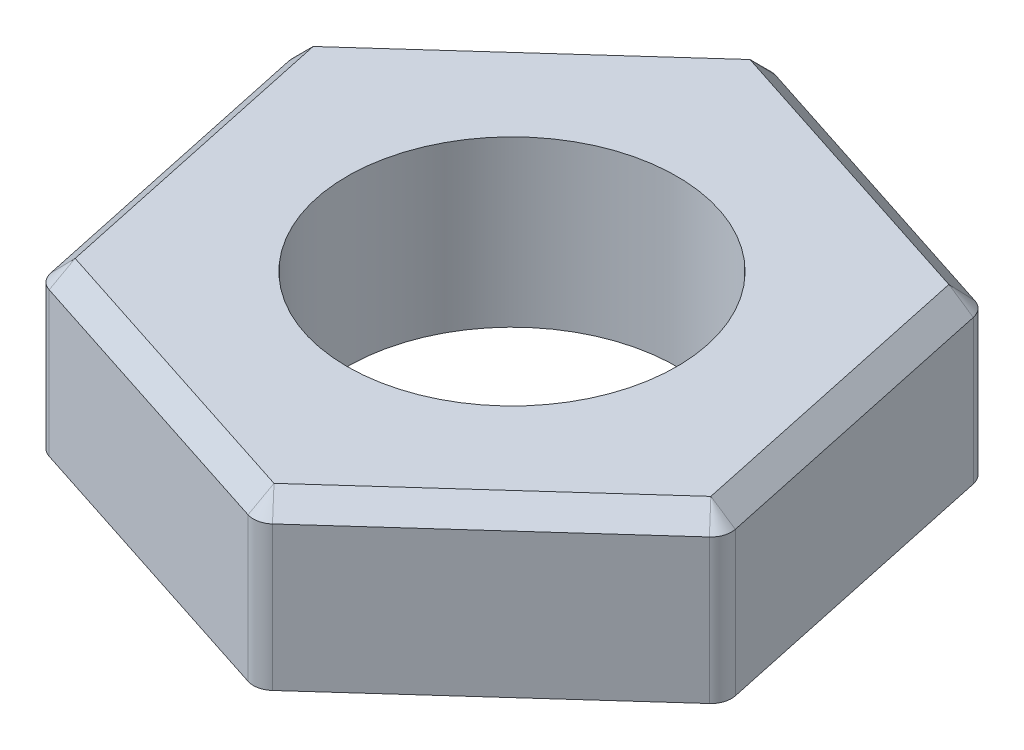
ISO-10303-21;
HEADER;
FILE_DESCRIPTION(('STEP AP214'),'2;1');
FILE_NAME('part.step','',(''),(''),'','','');
FILE_SCHEMA(('AUTOMOTIVE_DESIGN { 1 0 10303 214 1 1 1 1 }'));
ENDSEC;
DATA;
#1=APPLICATION_CONTEXT('core data for automotive mechanical design processes');
#2=APPLICATION_PROTOCOL_DEFINITION('international standard','automotive_design',2000,#1);
#3=PRODUCT_CONTEXT('',#1,'mechanical');
#4=PRODUCT('Part','Part','',(#3));
#5=PRODUCT_RELATED_PRODUCT_CATEGORY('part','',(#4));
#6=PRODUCT_DEFINITION_FORMATION('','',#4);
#7=PRODUCT_DEFINITION_CONTEXT('part definition',#1,'design');
#8=PRODUCT_DEFINITION('design','',#6,#7);
#9=PRODUCT_DEFINITION_SHAPE('','',#8);
#10=(LENGTH_UNIT() NAMED_UNIT(*) SI_UNIT(.MILLI.,.METRE.));
#11=(NAMED_UNIT(*) PLANE_ANGLE_UNIT() SI_UNIT($,.RADIAN.));
#12=(NAMED_UNIT(*) SI_UNIT($,.STERADIAN.) SOLID_ANGLE_UNIT());
#13=UNCERTAINTY_MEASURE_WITH_UNIT(LENGTH_MEASURE(1.E-05),#10,'distance_accuracy_value','');
#14=(GEOMETRIC_REPRESENTATION_CONTEXT(3) GLOBAL_UNCERTAINTY_ASSIGNED_CONTEXT((#13)) GLOBAL_UNIT_ASSIGNED_CONTEXT((#10,
#11,#12)) REPRESENTATION_CONTEXT('',''));
#15=CARTESIAN_POINT('',(0.,0.,0.));
#16=DIRECTION('',(0.,0.,1.));
#17=DIRECTION('',(1.,0.,0.));
#18=AXIS2_PLACEMENT_3D('',#15,#16,#17);
#19=CARTESIAN_POINT('',(7.68899946475982,4.,2.49251290152259));
#20=DIRECTION('',(-0.978005620651339,0.,0.208578536705934));
#21=DIRECTION('',(0.208578536705934,0.,0.978005620651339));
#22=AXIS2_PLACEMENT_3D('',#19,#20,#21);
#23=PLANE('',#22);
#24=DIRECTION('',(0.,-1.,0.));
#25=VECTOR('',#24,1.);
#26=CARTESIAN_POINT('',(6.06329066151611,4.,-5.13028651122965));
#27=LINE('',#26,#25);
#28=CARTESIAN_POINT('',(6.06329066151611,0.,-5.13028651122965));
#29=VERTEX_POINT('',#28);
#30=CARTESIAN_POINT('',(6.06329066151611,3.5,-5.13028651122965));
#31=VERTEX_POINT('',#30);
#32=EDGE_CURVE('E155',#29,#31,#27,.F.);
#33=ORIENTED_EDGE('',*,*,#32,.T.);
#34=DIRECTION('',(0.208578536705934,0.,0.978005620651339));
#35=VECTOR('',#34,1.);
#36=CARTESIAN_POINT('',(7.62878802760264,3.5,2.21018699734658));
#37=LINE('',#36,#35);
#38=CARTESIAN_POINT('',(7.62878802760264,3.5,2.21018699734658));
#39=VERTEX_POINT('',#38);
#40=EDGE_CURVE('E151',#31,#39,#37,.T.);
#41=ORIENTED_EDGE('',*,*,#40,.T.);
#42=DIRECTION('',(0.,-1.,0.));
#43=VECTOR('',#42,1.);
#44=CARTESIAN_POINT('',(7.62878802760264,4.,2.21018699734658));
#45=LINE('',#44,#43);
#46=CARTESIAN_POINT('',(7.62878802760264,0.,2.21018699734658));
#47=VERTEX_POINT('',#46);
#48=EDGE_CURVE('E144',#39,#47,#45,.T.);
#49=ORIENTED_EDGE('',*,*,#48,.T.);
#50=DIRECTION('',(-0.208578536705934,0.,-0.978005620651339));
#51=VECTOR('',#50,1.);
#52=CARTESIAN_POINT('',(7.68899946475982,0.,2.49251290152259));
#53=LINE('',#52,#51);
#54=EDGE_CURVE('E148',#47,#29,#53,.T.);
#55=ORIENTED_EDGE('',*,*,#54,.T.);
#56=EDGE_LOOP('',(#33,#41,#49,#55));
#57=FACE_BOUND('',#56,.T.);
#58=ADVANCED_FACE('F36',(#57),#23,.F.);
#59=CARTESIAN_POINT('',(6.00307922435893,4.,-5.41261241540566));
#60=DIRECTION('',(-0.308368498854146,0.,0.951266980880993));
#61=DIRECTION('',(0.951266980880993,0.,0.308368498854146));
#62=AXIS2_PLACEMENT_3D('',#59,#60,#61);
#63=PLANE('',#62);
#64=DIRECTION('',(0.,-1.,0.));
#65=VECTOR('',#64,1.);
#66=CARTESIAN_POINT('',(-1.41131311665946,4.,-7.81610699901673));
#67=LINE('',#66,#65);
#68=CARTESIAN_POINT('',(-1.41131311665946,0.,-7.81610699901673));
#69=VERTEX_POINT('',#68);
#70=CARTESIAN_POINT('',(-1.41131311665946,3.5,-7.81610699901673));
#71=VERTEX_POINT('',#70);
#72=EDGE_CURVE('E219',#69,#71,#67,.F.);
#73=ORIENTED_EDGE('',*,*,#72,.T.);
#74=DIRECTION('',(0.951266980880993,0.,0.308368498854146));
#75=VECTOR('',#74,1.);
#76=CARTESIAN_POINT('',(5.72847210061751,3.5,-5.50163073331718));
#77=LINE('',#76,#75);
#78=CARTESIAN_POINT('',(5.72847210061751,3.5,-5.50163073331718));
#79=VERTEX_POINT('',#78);
#80=EDGE_CURVE('E235',#71,#79,#77,.T.);
#81=ORIENTED_EDGE('',*,*,#80,.T.);
#82=DIRECTION('',(0.,-1.,0.));
#83=VECTOR('',#82,1.);
#84=CARTESIAN_POINT('',(5.72847210061751,4.,-5.50163073331718));
#85=LINE('',#84,#83);
#86=CARTESIAN_POINT('',(5.72847210061751,0.,-5.50163073331718));
#87=VERTEX_POINT('',#86);
#88=EDGE_CURVE('E217',#79,#87,#85,.T.);
#89=ORIENTED_EDGE('',*,*,#88,.T.);
#90=DIRECTION('',(-0.951266980880993,0.,-0.308368498854146));
#91=VECTOR('',#90,1.);
#92=CARTESIAN_POINT('',(6.00307922435893,0.,-5.41261241540566));
#93=LINE('',#92,#91);
#94=EDGE_CURVE('E172',#87,#69,#93,.T.);
#95=ORIENTED_EDGE('',*,*,#94,.T.);
#96=EDGE_LOOP('',(#73,#81,#89,#95));
#97=FACE_BOUND('',#96,.T.);
#98=ADVANCED_FACE('F343',(#97),#63,.F.);
#99=CARTESIAN_POINT('',(-1.68592024040089,4.,-7.90512531692825));
#100=DIRECTION('',(0.669637121797193,0.,0.74268844417506));
#101=DIRECTION('',(0.74268844417506,0.,-0.669637121797193));
#102=AXIS2_PLACEMENT_3D('',#99,#100,#101);
#103=PLANE('',#102);
#104=DIRECTION('',(0.,-1.,0.));
#105=VECTOR('',#104,1.);
#106=CARTESIAN_POINT('',(-7.47460377817557,4.,-2.68582048778708));
#107=LINE('',#106,#105);
#108=CARTESIAN_POINT('',(-7.47460377817557,0.,-2.68582048778708));
#109=VERTEX_POINT('',#108);
#110=CARTESIAN_POINT('',(-7.47460377817557,3.5,-2.68582048778708));
#111=VERTEX_POINT('',#110);
#112=EDGE_CURVE('E214',#109,#111,#107,.F.);
#113=ORIENTED_EDGE('',*,*,#112,.T.);
#114=DIRECTION('',(0.74268844417506,0.,-0.669637121797193));
#115=VECTOR('',#114,1.);
#116=CARTESIAN_POINT('',(-1.90031592698513,3.5,-7.71181773066376));
#117=LINE('',#116,#115);
#118=CARTESIAN_POINT('',(-1.90031592698513,3.5,-7.71181773066376));
#119=VERTEX_POINT('',#118);
#120=EDGE_CURVE('E242',#111,#119,#117,.T.);
#121=ORIENTED_EDGE('',*,*,#120,.T.);
#122=DIRECTION('',(0.,-1.,0.));
#123=VECTOR('',#122,1.);
#124=CARTESIAN_POINT('',(-1.90031592698513,4.,-7.71181773066376));
#125=LINE('',#124,#123);
#126=CARTESIAN_POINT('',(-1.90031592698513,0.,-7.71181773066376));
#127=VERTEX_POINT('',#126);
#128=EDGE_CURVE('E212',#119,#127,#125,.T.);
#129=ORIENTED_EDGE('',*,*,#128,.T.);
#130=DIRECTION('',(-0.74268844417506,0.,0.669637121797193));
#131=VECTOR('',#130,1.);
#132=CARTESIAN_POINT('',(-1.68592024040089,0.,-7.90512531692825));
#133=LINE('',#132,#131);
#134=EDGE_CURVE('E175',#127,#109,#133,.T.);
#135=ORIENTED_EDGE('',*,*,#134,.T.);
#136=EDGE_LOOP('',(#113,#121,#129,#135));
#137=FACE_BOUND('',#136,.T.);
#138=ADVANCED_FACE('F348',(#137),#103,.F.);
#139=CARTESIAN_POINT('',(-7.68899946475982,4.,-2.49251290152259));
#140=DIRECTION('',(0.978005620651339,0.,-0.208578536705934));
#141=DIRECTION('',(-0.208578536705934,0.,-0.978005620651339));
#142=AXIS2_PLACEMENT_3D('',#139,#140,#141);
#143=PLANE('',#142);
#144=DIRECTION('',(0.,-1.,0.));
#145=VECTOR('',#144,1.);
#146=CARTESIAN_POINT('',(-6.0632906615161,4.,5.13028651122965));
#147=LINE('',#146,#145);
#148=CARTESIAN_POINT('',(-6.0632906615161,0.,5.13028651122965));
#149=VERTEX_POINT('',#148);
#150=CARTESIAN_POINT('',(-6.0632906615161,3.5,5.13028651122965));
#151=VERTEX_POINT('',#150);
#152=EDGE_CURVE('E209',#149,#151,#147,.F.);
#153=ORIENTED_EDGE('',*,*,#152,.T.);
#154=DIRECTION('',(-0.208578536705934,0.,-0.978005620651339));
#155=VECTOR('',#154,1.);
#156=CARTESIAN_POINT('',(-7.62878802760264,3.5,-2.21018699734658));
#157=LINE('',#156,#155);
#158=CARTESIAN_POINT('',(-7.62878802760264,3.5,-2.21018699734658));
#159=VERTEX_POINT('',#158);
#160=EDGE_CURVE('E249',#151,#159,#157,.T.);
#161=ORIENTED_EDGE('',*,*,#160,.T.);
#162=DIRECTION('',(0.,-1.,0.));
#163=VECTOR('',#162,1.);
#164=CARTESIAN_POINT('',(-7.62878802760264,4.,-2.21018699734658));
#165=LINE('',#164,#163);
#166=CARTESIAN_POINT('',(-7.62878802760264,0.,-2.21018699734658));
#167=VERTEX_POINT('',#166);
#168=EDGE_CURVE('E207',#159,#167,#165,.T.);
#169=ORIENTED_EDGE('',*,*,#168,.T.);
#170=DIRECTION('',(0.208578536705934,0.,0.978005620651339));
#171=VECTOR('',#170,1.);
#172=CARTESIAN_POINT('',(-7.68899946475982,0.,-2.49251290152259));
#173=LINE('',#172,#171);
#174=EDGE_CURVE('E185',#167,#149,#173,.T.);
#175=ORIENTED_EDGE('',*,*,#174,.T.);
#176=EDGE_LOOP('',(#153,#161,#169,#175));
#177=FACE_BOUND('',#176,.T.);
#178=ADVANCED_FACE('F299',(#177),#143,.F.);
#179=CARTESIAN_POINT('',(-6.00307922435893,4.,5.41261241540567));
#180=DIRECTION('',(0.308368498854146,0.,-0.951266980880994));
#181=DIRECTION('',(-0.951266980880994,0.,-0.308368498854146));
#182=AXIS2_PLACEMENT_3D('',#179,#180,#181);
#183=PLANE('',#182);
#184=DIRECTION('',(0.,-1.,0.));
#185=VECTOR('',#184,1.);
#186=CARTESIAN_POINT('',(1.41131311665946,4.,7.81610699901673));
#187=LINE('',#186,#185);
#188=CARTESIAN_POINT('',(1.41131311665946,0.,7.81610699901673));
#189=VERTEX_POINT('',#188);
#190=CARTESIAN_POINT('',(1.41131311665946,3.5,7.81610699901673));
#191=VERTEX_POINT('',#190);
#192=EDGE_CURVE('E203',#189,#191,#187,.F.);
#193=ORIENTED_EDGE('',*,*,#192,.T.);
#194=DIRECTION('',(-0.951266980880994,0.,-0.308368498854146));
#195=VECTOR('',#194,1.);
#196=CARTESIAN_POINT('',(-5.72847210061751,3.5,5.50163073331719));
#197=LINE('',#196,#195);
#198=CARTESIAN_POINT('',(-5.72847210061751,3.5,5.50163073331719));
#199=VERTEX_POINT('',#198);
#200=EDGE_CURVE('E11',#191,#199,#197,.T.);
#201=ORIENTED_EDGE('',*,*,#200,.T.);
#202=DIRECTION('',(0.,-1.,0.));
#203=VECTOR('',#202,1.);
#204=CARTESIAN_POINT('',(-5.72847210061751,4.,5.50163073331719));
#205=LINE('',#204,#203);
#206=CARTESIAN_POINT('',(-5.72847210061751,0.,5.50163073331719));
#207=VERTEX_POINT('',#206);
#208=EDGE_CURVE('E205',#199,#207,#205,.T.);
#209=ORIENTED_EDGE('',*,*,#208,.T.);
#210=DIRECTION('',(0.951266980880994,0.,0.308368498854146));
#211=VECTOR('',#210,1.);
#212=CARTESIAN_POINT('',(-6.00307922435893,0.,5.41261241540567));
#213=LINE('',#212,#211);
#214=EDGE_CURVE('E188',#207,#189,#213,.T.);
#215=ORIENTED_EDGE('',*,*,#214,.T.);
#216=EDGE_LOOP('',(#193,#201,#209,#215));
#217=FACE_BOUND('',#216,.T.);
#218=ADVANCED_FACE('F311',(#217),#183,.F.);
#219=CARTESIAN_POINT('',(1.68592024040088,4.,7.90512531692825));
#220=DIRECTION('',(-0.669637121797193,0.,-0.74268844417506));
#221=DIRECTION('',(-0.74268844417506,0.,0.669637121797193));
#222=AXIS2_PLACEMENT_3D('',#219,#220,#221);
#223=PLANE('',#222);
#224=DIRECTION('',(0.,-1.,0.));
#225=VECTOR('',#224,1.);
#226=CARTESIAN_POINT('',(7.47460377817557,4.,2.68582048778708));
#227=LINE('',#226,#225);
#228=CARTESIAN_POINT('',(7.47460377817557,0.,2.68582048778707));
#229=VERTEX_POINT('',#228);
#230=CARTESIAN_POINT('',(7.47460377817557,3.5,2.68582048778708));
#231=VERTEX_POINT('',#230);
#232=EDGE_CURVE('E161',#229,#231,#227,.F.);
#233=ORIENTED_EDGE('',*,*,#232,.T.);
#234=DIRECTION('',(-0.74268844417506,0.,0.669637121797193));
#235=VECTOR('',#234,1.);
#236=CARTESIAN_POINT('',(1.90031592698513,3.5,7.71181773066376));
#237=LINE('',#236,#235);
#238=CARTESIAN_POINT('',(1.90031592698513,3.5,7.71181773066376));
#239=VERTEX_POINT('',#238);
#240=EDGE_CURVE('E251',#231,#239,#237,.T.);
#241=ORIENTED_EDGE('',*,*,#240,.T.);
#242=DIRECTION('',(0.,-1.,0.));
#243=VECTOR('',#242,1.);
#244=CARTESIAN_POINT('',(1.90031592698513,4.,7.71181773066376));
#245=LINE('',#244,#243);
#246=CARTESIAN_POINT('',(1.90031592698513,0.,7.71181773066376));
#247=VERTEX_POINT('',#246);
#248=EDGE_CURVE('E165',#239,#247,#245,.T.);
#249=ORIENTED_EDGE('',*,*,#248,.T.);
#250=DIRECTION('',(0.74268844417506,0.,-0.669637121797193));
#251=VECTOR('',#250,1.);
#252=CARTESIAN_POINT('',(1.68592024040088,0.,7.90512531692825));
#253=LINE('',#252,#251);
#254=EDGE_CURVE('E191',#247,#229,#253,.T.);
#255=ORIENTED_EDGE('',*,*,#254,.T.);
#256=EDGE_LOOP('',(#233,#241,#249,#255));
#257=FACE_BOUND('',#256,.T.);
#258=ADVANCED_FACE('F315',(#257),#223,.F.);
#259=CARTESIAN_POINT('',(0.,4.,0.));
#260=DIRECTION('',(0.,1.,0.));
#261=DIRECTION('',(0.,0.,1.));
#262=AXIS2_PLACEMENT_3D('',#259,#260,#261);
#263=PLANE('',#262);
#264=CARTESIAN_POINT('',(0.,4.,0.));
#265=DIRECTION('',(0.,1.,0.));
#266=DIRECTION('',(0.,0.,1.));
#267=AXIS2_PLACEMENT_3D('',#264,#265,#266);
#268=CIRCLE('',#267,4.);
#269=CARTESIAN_POINT('',(0.,4.,4.));
#270=VERTEX_POINT('',#269);
#271=EDGE_CURVE('E180',#270,#270,#268,.F.);
#272=ORIENTED_EDGE('',*,*,#271,.T.);
#273=EDGE_LOOP('',(#272));
#274=FACE_BOUND('',#273,.T.);
#275=DIRECTION('',(-0.208578536705934,0.,-0.978005620651339));
#276=VECTOR('',#275,1.);
#277=CARTESIAN_POINT('',(5.57428785119043,4.,-5.02599724287668));
#278=LINE('',#277,#276);
#279=CARTESIAN_POINT('',(7.13978521727697,4.,2.31447626569955));
#280=VERTEX_POINT('',#279);
#281=CARTESIAN_POINT('',(5.57428785119043,4.,-5.02599724287668));
#282=VERTEX_POINT('',#281);
#283=EDGE_CURVE('E228',#280,#282,#278,.T.);
#284=ORIENTED_EDGE('',*,*,#283,.T.);
#285=DIRECTION('',(-0.951266980880993,0.,-0.308368498854146));
#286=VECTOR('',#285,1.);
#287=CARTESIAN_POINT('',(-1.56549736608654,4.,-7.34047350857623));
#288=LINE('',#287,#286);
#289=CARTESIAN_POINT('',(-1.56549736608654,4.,-7.34047350857623));
#290=VERTEX_POINT('',#289);
#291=EDGE_CURVE('E232',#282,#290,#288,.T.);
#292=ORIENTED_EDGE('',*,*,#291,.T.);
#293=DIRECTION('',(-0.74268844417506,0.,0.669637121797193));
#294=VECTOR('',#293,1.);
#295=CARTESIAN_POINT('',(-7.13978521727697,4.,-2.31447626569955));
#296=LINE('',#295,#294);
#297=CARTESIAN_POINT('',(-7.13978521727697,4.,-2.31447626569955));
#298=VERTEX_POINT('',#297);
#299=EDGE_CURVE('E230',#290,#298,#296,.T.);
#300=ORIENTED_EDGE('',*,*,#299,.T.);
#301=DIRECTION('',(0.208578536705934,0.,0.978005620651339));
#302=VECTOR('',#301,1.);
#303=CARTESIAN_POINT('',(-5.57428785119043,4.,5.02599724287669));
#304=LINE('',#303,#302);
#305=CARTESIAN_POINT('',(-5.57428785119043,4.,5.02599724287669));
#306=VERTEX_POINT('',#305);
#307=EDGE_CURVE('E226',#298,#306,#304,.T.);
#308=ORIENTED_EDGE('',*,*,#307,.T.);
#309=DIRECTION('',(0.951266980880994,0.,0.308368498854146));
#310=VECTOR('',#309,1.);
#311=CARTESIAN_POINT('',(1.56549736608653,4.,7.34047350857623));
#312=LINE('',#311,#310);
#313=CARTESIAN_POINT('',(1.56549736608654,4.,7.34047350857623));
#314=VERTEX_POINT('',#313);
#315=EDGE_CURVE('E222',#306,#314,#312,.T.);
#316=ORIENTED_EDGE('',*,*,#315,.T.);
#317=DIRECTION('',(0.74268844417506,0.,-0.669637121797193));
#318=VECTOR('',#317,1.);
#319=CARTESIAN_POINT('',(7.13978521727697,4.,2.31447626569955));
#320=LINE('',#319,#318);
#321=EDGE_CURVE('E224',#314,#280,#320,.T.);
#322=ORIENTED_EDGE('',*,*,#321,.T.);
#323=EDGE_LOOP('',(#284,#292,#300,#308,#316,#322));
#324=FACE_BOUND('',#323,.T.);
#325=ADVANCED_FACE('F331',(#274,#324),#263,.T.);
#326=CARTESIAN_POINT('',(0.,0.,0.));
#327=DIRECTION('',(0.,1.,0.));
#328=DIRECTION('',(0.,0.,1.));
#329=AXIS2_PLACEMENT_3D('',#326,#327,#328);
#330=PLANE('',#329);
#331=CARTESIAN_POINT('',(0.,0.,0.));
#332=DIRECTION('',(0.,1.,0.));
#333=DIRECTION('',(0.,0.,1.));
#334=AXIS2_PLACEMENT_3D('',#331,#332,#333);
#335=CIRCLE('',#334,4.);
#336=CARTESIAN_POINT('',(0.,0.,4.));
#337=VERTEX_POINT('',#336);
#338=EDGE_CURVE('E586',#337,#337,#335,.T.);
#339=ORIENTED_EDGE('',*,*,#338,.T.);
#340=EDGE_LOOP('',(#339));
#341=FACE_BOUND('',#340,.T.);
#342=ORIENTED_EDGE('',*,*,#54,.F.);
#343=CARTESIAN_POINT('',(7.13978521727697,0.,2.31447626569955));
#344=DIRECTION('',(0.,1.,0.));
#345=DIRECTION('',(0.,0.,1.));
#346=AXIS2_PLACEMENT_3D('',#343,#344,#345);
#347=CIRCLE('',#346,0.5);
#348=EDGE_CURVE('E158',#47,#229,#347,.F.);
#349=ORIENTED_EDGE('',*,*,#348,.T.);
#350=ORIENTED_EDGE('',*,*,#254,.F.);
#351=CARTESIAN_POINT('',(1.56549736608654,0.,7.34047350857623));
#352=DIRECTION('',(0.,1.,0.));
#353=DIRECTION('',(0.,0.,1.));
#354=AXIS2_PLACEMENT_3D('',#351,#352,#353);
#355=CIRCLE('',#354,0.5);
#356=EDGE_CURVE('E154',#247,#189,#355,.F.);
#357=ORIENTED_EDGE('',*,*,#356,.T.);
#358=ORIENTED_EDGE('',*,*,#214,.F.);
#359=CARTESIAN_POINT('',(-5.57428785119043,0.,5.02599724287669));
#360=DIRECTION('',(0.,1.,0.));
#361=DIRECTION('',(0.,0.,1.));
#362=AXIS2_PLACEMENT_3D('',#359,#360,#361);
#363=CIRCLE('',#362,0.5);
#364=EDGE_CURVE('E166',#207,#149,#363,.F.);
#365=ORIENTED_EDGE('',*,*,#364,.T.);
#366=ORIENTED_EDGE('',*,*,#174,.F.);
#367=CARTESIAN_POINT('',(-7.13978521727697,0.,-2.31447626569955));
#368=DIRECTION('',(0.,1.,0.));
#369=DIRECTION('',(0.,0.,1.));
#370=AXIS2_PLACEMENT_3D('',#367,#368,#369);
#371=CIRCLE('',#370,0.5);
#372=EDGE_CURVE('E198',#167,#109,#371,.F.);
#373=ORIENTED_EDGE('',*,*,#372,.T.);
#374=ORIENTED_EDGE('',*,*,#134,.F.);
#375=CARTESIAN_POINT('',(-1.56549736608654,0.,-7.34047350857623));
#376=DIRECTION('',(0.,1.,0.));
#377=DIRECTION('',(0.,0.,1.));
#378=AXIS2_PLACEMENT_3D('',#375,#376,#377);
#379=CIRCLE('',#378,0.5);
#380=EDGE_CURVE('E196',#127,#69,#379,.F.);
#381=ORIENTED_EDGE('',*,*,#380,.T.);
#382=ORIENTED_EDGE('',*,*,#94,.F.);
#383=CARTESIAN_POINT('',(5.57428785119044,0.,-5.02599724287668));
#384=DIRECTION('',(0.,1.,0.));
#385=DIRECTION('',(0.,0.,1.));
#386=AXIS2_PLACEMENT_3D('',#383,#384,#385);
#387=CIRCLE('',#386,0.5);
#388=EDGE_CURVE('E171',#87,#29,#387,.F.);
#389=ORIENTED_EDGE('',*,*,#388,.T.);
#390=EDGE_LOOP('',(#342,#349,#350,#357,#358,#365,#366,#373,#374,#381,#382,#389));
#391=FACE_BOUND('',#390,.T.);
#392=ADVANCED_FACE('F168',(#341,#391),#330,.F.);
#393=CARTESIAN_POINT('',(7.13978521727697,4.,2.31447626569955));
#394=DIRECTION('',(0.,-1.,0.));
#395=DIRECTION('',(0.,0.,-1.));
#396=AXIS2_PLACEMENT_3D('',#393,#394,#395);
#397=CYLINDRICAL_SURFACE('',#396,0.5);
#398=ORIENTED_EDGE('',*,*,#48,.F.);
#399=CARTESIAN_POINT('',(7.13978521727697,3.5,2.31447626569955));
#400=DIRECTION('',(0.,1.,0.));
#401=DIRECTION('',(0.,0.,1.));
#402=AXIS2_PLACEMENT_3D('',#399,#400,#401);
#403=CIRCLE('',#402,0.5);
#404=EDGE_CURVE('E247',#39,#231,#403,.F.);
#405=ORIENTED_EDGE('',*,*,#404,.T.);
#406=ORIENTED_EDGE('',*,*,#232,.F.);
#407=ORIENTED_EDGE('',*,*,#348,.F.);
#408=EDGE_LOOP('',(#398,#405,#406,#407));
#409=FACE_BOUND('',#408,.T.);
#410=ADVANCED_FACE('F159',(#409),#397,.T.);
#411=CARTESIAN_POINT('',(-5.57428785119043,4.,5.02599724287669));
#412=DIRECTION('',(0.,-1.,0.));
#413=DIRECTION('',(0.,0.,-1.));
#414=AXIS2_PLACEMENT_3D('',#411,#412,#413);
#415=CYLINDRICAL_SURFACE('',#414,0.5);
#416=ORIENTED_EDGE('',*,*,#208,.F.);
#417=CARTESIAN_POINT('',(-5.57428785119043,3.5,5.02599724287669));
#418=DIRECTION('',(0.,1.,0.));
#419=DIRECTION('',(0.,0.,1.));
#420=AXIS2_PLACEMENT_3D('',#417,#418,#419);
#421=CIRCLE('',#420,0.5);
#422=EDGE_CURVE('E253',#199,#151,#421,.F.);
#423=ORIENTED_EDGE('',*,*,#422,.T.);
#424=ORIENTED_EDGE('',*,*,#152,.F.);
#425=ORIENTED_EDGE('',*,*,#364,.F.);
#426=EDGE_LOOP('',(#416,#423,#424,#425));
#427=FACE_BOUND('',#426,.T.);
#428=ADVANCED_FACE('F310',(#427),#415,.T.);
#429=CARTESIAN_POINT('',(-7.13978521727697,4.,-2.31447626569955));
#430=DIRECTION('',(0.,-1.,0.));
#431=DIRECTION('',(0.,0.,-1.));
#432=AXIS2_PLACEMENT_3D('',#429,#430,#431);
#433=CYLINDRICAL_SURFACE('',#432,0.5);
#434=ORIENTED_EDGE('',*,*,#168,.F.);
#435=CARTESIAN_POINT('',(-7.13978521727697,3.5,-2.31447626569955));
#436=DIRECTION('',(0.,1.,0.));
#437=DIRECTION('',(0.,0.,1.));
#438=AXIS2_PLACEMENT_3D('',#435,#436,#437);
#439=CIRCLE('',#438,0.5);
#440=EDGE_CURVE('E245',#159,#111,#439,.F.);
#441=ORIENTED_EDGE('',*,*,#440,.T.);
#442=ORIENTED_EDGE('',*,*,#112,.F.);
#443=ORIENTED_EDGE('',*,*,#372,.F.);
#444=EDGE_LOOP('',(#434,#441,#442,#443));
#445=FACE_BOUND('',#444,.T.);
#446=ADVANCED_FACE('F303',(#445),#433,.T.);
#447=CARTESIAN_POINT('',(-1.56549736608654,4.,-7.34047350857623));
#448=DIRECTION('',(0.,-1.,0.));
#449=DIRECTION('',(0.,0.,-1.));
#450=AXIS2_PLACEMENT_3D('',#447,#448,#449);
#451=CYLINDRICAL_SURFACE('',#450,0.5);
#452=ORIENTED_EDGE('',*,*,#128,.F.);
#453=CARTESIAN_POINT('',(-1.56549736608654,3.5,-7.34047350857623));
#454=DIRECTION('',(0.,1.,0.));
#455=DIRECTION('',(0.,0.,1.));
#456=AXIS2_PLACEMENT_3D('',#453,#454,#455);
#457=CIRCLE('',#456,0.5);
#458=EDGE_CURVE('E238',#119,#71,#457,.F.);
#459=ORIENTED_EDGE('',*,*,#458,.T.);
#460=ORIENTED_EDGE('',*,*,#72,.F.);
#461=ORIENTED_EDGE('',*,*,#380,.F.);
#462=EDGE_LOOP('',(#452,#459,#460,#461));
#463=FACE_BOUND('',#462,.T.);
#464=ADVANCED_FACE('F359',(#463),#451,.T.);
#465=CARTESIAN_POINT('',(5.57428785119044,4.,-5.02599724287668));
#466=DIRECTION('',(0.,-1.,0.));
#467=DIRECTION('',(0.,0.,-1.));
#468=AXIS2_PLACEMENT_3D('',#465,#466,#467);
#469=CYLINDRICAL_SURFACE('',#468,0.5);
#470=ORIENTED_EDGE('',*,*,#88,.F.);
#471=CARTESIAN_POINT('',(5.57428785119044,3.5,-5.02599724287668));
#472=DIRECTION('',(0.,1.,0.));
#473=DIRECTION('',(0.,0.,1.));
#474=AXIS2_PLACEMENT_3D('',#471,#472,#473);
#475=CIRCLE('',#474,0.5);
#476=EDGE_CURVE('E240',#79,#31,#475,.F.);
#477=ORIENTED_EDGE('',*,*,#476,.T.);
#478=ORIENTED_EDGE('',*,*,#32,.F.);
#479=ORIENTED_EDGE('',*,*,#388,.F.);
#480=EDGE_LOOP('',(#470,#477,#478,#479));
#481=FACE_BOUND('',#480,.T.);
#482=ADVANCED_FACE('F362',(#481),#469,.T.);
#483=CARTESIAN_POINT('',(1.56549736608654,4.,7.34047350857623));
#484=DIRECTION('',(0.,-1.,0.));
#485=DIRECTION('',(0.,0.,-1.));
#486=AXIS2_PLACEMENT_3D('',#483,#484,#485);
#487=CYLINDRICAL_SURFACE('',#486,0.5);
#488=ORIENTED_EDGE('',*,*,#248,.F.);
#489=CARTESIAN_POINT('',(1.56549736608654,3.5,7.34047350857623));
#490=DIRECTION('',(0.,1.,0.));
#491=DIRECTION('',(0.,0.,1.));
#492=AXIS2_PLACEMENT_3D('',#489,#490,#491);
#493=CIRCLE('',#492,0.5);
#494=EDGE_CURVE('E45',#239,#191,#493,.F.);
#495=ORIENTED_EDGE('',*,*,#494,.T.);
#496=ORIENTED_EDGE('',*,*,#192,.F.);
#497=ORIENTED_EDGE('',*,*,#356,.F.);
#498=EDGE_LOOP('',(#488,#495,#496,#497));
#499=FACE_BOUND('',#498,.T.);
#500=ADVANCED_FACE('F313',(#499),#487,.T.);
#501=CARTESIAN_POINT('',(-2.00439524255195,4.,6.18323537572646));
#502=DIRECTION('',(-0.218049456644083,0.707106781186545,0.672647332899807));
#503=DIRECTION('',(-0.951266980880994,0.,-0.308368498854146));
#504=AXIS2_PLACEMENT_3D('',#501,#502,#503);
#505=PLANE('',#504);
#506=DIRECTION('',(0.218049456644082,0.70710678118655,-0.672647332899802));
#507=VECTOR('',#506,1.);
#508=CARTESIAN_POINT('',(-5.72847210061751,3.5,5.50163073331719));
#509=LINE('',#508,#507);
#510=EDGE_CURVE('E178',#199,#306,#509,.T.);
#511=ORIENTED_EDGE('',*,*,#510,.F.);
#512=ORIENTED_EDGE('',*,*,#200,.F.);
#513=DIRECTION('',(-0.218049456644084,-0.70710678118655,0.672647332899802));
#514=VECTOR('',#513,1.);
#515=CARTESIAN_POINT('',(1.56549736608654,4.,7.34047350857623));
#516=LINE('',#515,#514);
#517=EDGE_CURVE('E40',#314,#191,#516,.T.);
#518=ORIENTED_EDGE('',*,*,#517,.F.);
#519=ORIENTED_EDGE('',*,*,#315,.F.);
#520=EDGE_LOOP('',(#511,#512,#518,#519));
#521=FACE_BOUND('',#520,.T.);
#522=ADVANCED_FACE('F38',(#521),#505,.T.);
#523=CARTESIAN_POINT('',(1.56549736608654,3.5,7.34047350857623));
#524=DIRECTION('',(0.,-1.,0.));
#525=DIRECTION('',(0.,0.,-1.));
#526=AXIS2_PLACEMENT_3D('',#523,#524,#525);
#527=CONICAL_SURFACE('',#526,0.5,0.785398163397445);
#528=ORIENTED_EDGE('',*,*,#517,.T.);
#529=ORIENTED_EDGE('',*,*,#494,.F.);
#530=DIRECTION('',(0.473504949757036,-0.70710678118655,0.525160035185069));
#531=VECTOR('',#530,1.);
#532=CARTESIAN_POINT('',(1.56549736608654,4.,7.34047350857623));
#533=LINE('',#532,#531);
#534=EDGE_CURVE('E281',#314,#239,#533,.T.);
#535=ORIENTED_EDGE('',*,*,#534,.F.);
#536=EDGE_LOOP('',(#528,#529,#535));
#537=FACE_BOUND('',#536,.T.);
#538=ADVANCED_FACE('F335',(#537),#527,.T.);
#539=CARTESIAN_POINT('',(-5.57428785119043,3.5,5.02599724287669));
#540=DIRECTION('',(0.,-1.,0.));
#541=DIRECTION('',(0.,0.,-1.));
#542=AXIS2_PLACEMENT_3D('',#539,#540,#541);
#543=CONICAL_SURFACE('',#542,0.5,0.785398163397445);
#544=ORIENTED_EDGE('',*,*,#422,.F.);
#545=ORIENTED_EDGE('',*,*,#510,.T.);
#546=DIRECTION('',(0.691554406401119,0.707106781186549,-0.147487297714732));
#547=VECTOR('',#546,1.);
#548=CARTESIAN_POINT('',(-6.0632906615161,3.5,5.13028651122965));
#549=LINE('',#548,#547);
#550=EDGE_CURVE('E278',#151,#306,#549,.T.);
#551=ORIENTED_EDGE('',*,*,#550,.F.);
#552=EDGE_LOOP('',(#544,#545,#551));
#553=FACE_BOUND('',#552,.T.);
#554=ADVANCED_FACE('F288',(#553),#543,.T.);
#555=CARTESIAN_POINT('',(4.35264129168175,4.,4.82747488713789));
#556=DIRECTION('',(0.473504949757039,0.707106781186545,0.525160035185073));
#557=DIRECTION('',(-0.74268844417506,0.,0.669637121797193));
#558=AXIS2_PLACEMENT_3D('',#555,#556,#557);
#559=PLANE('',#558);
#560=ORIENTED_EDGE('',*,*,#534,.T.);
#561=ORIENTED_EDGE('',*,*,#240,.F.);
#562=DIRECTION('',(0.473504949757036,-0.70710678118655,0.52516003518507));
#563=VECTOR('',#562,1.);
#564=CARTESIAN_POINT('',(7.13978521727697,4.,2.31447626569955));
#565=LINE('',#564,#563);
#566=EDGE_CURVE('E275',#280,#231,#565,.T.);
#567=ORIENTED_EDGE('',*,*,#566,.F.);
#568=ORIENTED_EDGE('',*,*,#321,.F.);
#569=EDGE_LOOP('',(#560,#561,#567,#568));
#570=FACE_BOUND('',#569,.T.);
#571=ADVANCED_FACE('F319',(#570),#559,.T.);
#572=CARTESIAN_POINT('',(-6.3570365342337,4.,1.35576048858857));
#573=DIRECTION('',(-0.691554406401122,0.707106781186546,0.147487297714733));
#574=DIRECTION('',(-0.208578536705934,0.,-0.978005620651339));
#575=AXIS2_PLACEMENT_3D('',#572,#573,#574);
#576=PLANE('',#575);
#577=ORIENTED_EDGE('',*,*,#550,.T.);
#578=ORIENTED_EDGE('',*,*,#307,.F.);
#579=DIRECTION('',(0.691554406401119,0.707106781186549,-0.147487297714733));
#580=VECTOR('',#579,1.);
#581=CARTESIAN_POINT('',(-7.62878802760264,3.5,-2.21018699734658));
#582=LINE('',#581,#580);
#583=EDGE_CURVE('E272',#159,#298,#582,.T.);
#584=ORIENTED_EDGE('',*,*,#583,.F.);
#585=ORIENTED_EDGE('',*,*,#160,.F.);
#586=EDGE_LOOP('',(#577,#578,#584,#585));
#587=FACE_BOUND('',#586,.T.);
#588=ADVANCED_FACE('F294',(#587),#576,.T.);
#589=CARTESIAN_POINT('',(7.13978521727697,3.5,2.31447626569955));
#590=DIRECTION('',(0.,-1.,0.));
#591=DIRECTION('',(0.,0.,-1.));
#592=AXIS2_PLACEMENT_3D('',#589,#590,#591);
#593=CONICAL_SURFACE('',#592,0.5,0.785398163397445);
#594=ORIENTED_EDGE('',*,*,#566,.T.);
#595=ORIENTED_EDGE('',*,*,#404,.F.);
#596=DIRECTION('',(0.691554406401119,-0.707106781186549,-0.147487297714733));
#597=VECTOR('',#596,1.);
#598=CARTESIAN_POINT('',(7.13978521727697,4.,2.31447626569955));
#599=LINE('',#598,#597);
#600=EDGE_CURVE('E269',#280,#39,#599,.T.);
#601=ORIENTED_EDGE('',*,*,#600,.F.);
#602=EDGE_LOOP('',(#594,#595,#601));
#603=FACE_BOUND('',#602,.T.);
#604=ADVANCED_FACE('F324',(#603),#593,.T.);
#605=CARTESIAN_POINT('',(-7.13978521727697,3.5,-2.31447626569955));
#606=DIRECTION('',(0.,-1.,0.));
#607=DIRECTION('',(0.,0.,-1.));
#608=AXIS2_PLACEMENT_3D('',#605,#606,#607);
#609=CONICAL_SURFACE('',#608,0.5,0.785398163397445);
#610=ORIENTED_EDGE('',*,*,#440,.F.);
#611=ORIENTED_EDGE('',*,*,#583,.T.);
#612=DIRECTION('',(0.473504949757035,0.707106781186551,0.525160035185069));
#613=VECTOR('',#612,1.);
#614=CARTESIAN_POINT('',(-7.47460377817557,3.5,-2.68582048778708));
#615=LINE('',#614,#613);
#616=EDGE_CURVE('E266',#111,#298,#615,.T.);
#617=ORIENTED_EDGE('',*,*,#616,.F.);
#618=EDGE_LOOP('',(#610,#611,#617));
#619=FACE_BOUND('',#618,.T.);
#620=ADVANCED_FACE('F388',(#619),#609,.T.);
#621=CARTESIAN_POINT('',(6.3570365342337,4.,-1.35576048858857));
#622=DIRECTION('',(0.691554406401122,0.707106781186546,-0.147487297714733));
#623=DIRECTION('',(0.208578536705934,0.,0.978005620651339));
#624=AXIS2_PLACEMENT_3D('',#621,#622,#623);
#625=PLANE('',#624);
#626=ORIENTED_EDGE('',*,*,#600,.T.);
#627=ORIENTED_EDGE('',*,*,#40,.F.);
#628=DIRECTION('',(0.691554406401119,-0.707106781186549,-0.147487297714734));
#629=VECTOR('',#628,1.);
#630=CARTESIAN_POINT('',(5.57428785119043,4.,-5.02599724287668));
#631=LINE('',#630,#629);
#632=EDGE_CURVE('E263',#282,#31,#631,.T.);
#633=ORIENTED_EDGE('',*,*,#632,.F.);
#634=ORIENTED_EDGE('',*,*,#283,.F.);
#635=EDGE_LOOP('',(#626,#627,#633,#634));
#636=FACE_BOUND('',#635,.T.);
#637=ADVANCED_FACE('F328',(#636),#625,.T.);
#638=CARTESIAN_POINT('',(-4.35264129168176,4.,-4.82747488713789));
#639=DIRECTION('',(-0.47350494975704,0.707106781186544,-0.525160035185074));
#640=DIRECTION('',(0.74268844417506,0.,-0.669637121797193));
#641=AXIS2_PLACEMENT_3D('',#638,#639,#640);
#642=PLANE('',#641);
#643=ORIENTED_EDGE('',*,*,#616,.T.);
#644=ORIENTED_EDGE('',*,*,#299,.F.);
#645=DIRECTION('',(0.473504949757035,0.707106781186551,0.525160035185069));
#646=VECTOR('',#645,1.);
#647=CARTESIAN_POINT('',(-1.90031592698513,3.5,-7.71181773066376));
#648=LINE('',#647,#646);
#649=EDGE_CURVE('E260',#119,#290,#648,.T.);
#650=ORIENTED_EDGE('',*,*,#649,.F.);
#651=ORIENTED_EDGE('',*,*,#120,.F.);
#652=EDGE_LOOP('',(#643,#644,#650,#651));
#653=FACE_BOUND('',#652,.T.);
#654=ADVANCED_FACE('F381',(#653),#642,.T.);
#655=CARTESIAN_POINT('',(5.57428785119044,3.5,-5.02599724287668));
#656=DIRECTION('',(0.,-1.,0.));
#657=DIRECTION('',(0.,0.,-1.));
#658=AXIS2_PLACEMENT_3D('',#655,#656,#657);
#659=CONICAL_SURFACE('',#658,0.5,0.785398163397445);
#660=ORIENTED_EDGE('',*,*,#632,.T.);
#661=ORIENTED_EDGE('',*,*,#476,.F.);
#662=DIRECTION('',(0.218049456644083,-0.70710678118655,-0.672647332899802));
#663=VECTOR('',#662,1.);
#664=CARTESIAN_POINT('',(5.57428785119044,4.,-5.02599724287668));
#665=LINE('',#664,#663);
#666=EDGE_CURVE('E258',#282,#79,#665,.T.);
#667=ORIENTED_EDGE('',*,*,#666,.F.);
#668=EDGE_LOOP('',(#660,#661,#667));
#669=FACE_BOUND('',#668,.T.);
#670=ADVANCED_FACE('F377',(#669),#659,.T.);
#671=CARTESIAN_POINT('',(-1.56549736608654,3.5,-7.34047350857623));
#672=DIRECTION('',(0.,-1.,0.));
#673=DIRECTION('',(0.,0.,-1.));
#674=AXIS2_PLACEMENT_3D('',#671,#672,#673);
#675=CONICAL_SURFACE('',#674,0.5,0.785398163397445);
#676=ORIENTED_EDGE('',*,*,#458,.F.);
#677=ORIENTED_EDGE('',*,*,#649,.T.);
#678=DIRECTION('',(-0.218049456644083,0.707106781186551,0.672647332899801));
#679=VECTOR('',#678,1.);
#680=CARTESIAN_POINT('',(-1.41131311665946,3.5,-7.81610699901673));
#681=LINE('',#680,#679);
#682=EDGE_CURVE('E256',#71,#290,#681,.T.);
#683=ORIENTED_EDGE('',*,*,#682,.F.);
#684=EDGE_LOOP('',(#676,#677,#683));
#685=FACE_BOUND('',#684,.T.);
#686=ADVANCED_FACE('F373',(#685),#675,.T.);
#687=CARTESIAN_POINT('',(2.00439524255195,4.,-6.18323537572646));
#688=DIRECTION('',(0.218049456644084,0.707106781186544,-0.672647332899807));
#689=DIRECTION('',(0.951266980880993,0.,0.308368498854146));
#690=AXIS2_PLACEMENT_3D('',#687,#688,#689);
#691=PLANE('',#690);
#692=ORIENTED_EDGE('',*,*,#666,.T.);
#693=ORIENTED_EDGE('',*,*,#80,.F.);
#694=ORIENTED_EDGE('',*,*,#682,.T.);
#695=ORIENTED_EDGE('',*,*,#291,.F.);
#696=EDGE_LOOP('',(#692,#693,#694,#695));
#697=FACE_BOUND('',#696,.T.);
#698=ADVANCED_FACE('F369',(#697),#691,.T.);
#699=CARTESIAN_POINT('',(0.,8.,0.));
#700=DIRECTION('',(0.,-1.,0.));
#701=DIRECTION('',(0.,0.,-1.));
#702=AXIS2_PLACEMENT_3D('',#699,#700,#701);
#703=CYLINDRICAL_SURFACE('',#702,4.);
#704=ORIENTED_EDGE('',*,*,#271,.F.);
#705=EDGE_LOOP('',(#704));
#706=FACE_BOUND('',#705,.T.);
#707=ORIENTED_EDGE('',*,*,#338,.F.);
#708=EDGE_LOOP('',(#707));
#709=FACE_BOUND('',#708,.T.);
#710=ADVANCED_FACE('F372',(#706,#709),#703,.F.);
#711=CLOSED_SHELL('',(#58,#98,#138,#178,#218,#258,#325,#392,#410,#428,#446,#464,#482,#500,#522,
#538,#554,#571,#588,#604,#620,#637,#654,#670,#686,#698,#710));
#712=MANIFOLD_SOLID_BREP('B2',#711);
#713=ADVANCED_BREP_SHAPE_REPRESENTATION('',(#18,#712),#14);
#714=SHAPE_DEFINITION_REPRESENTATION(#9,#713);
ENDSEC;
END-ISO-10303-21;
